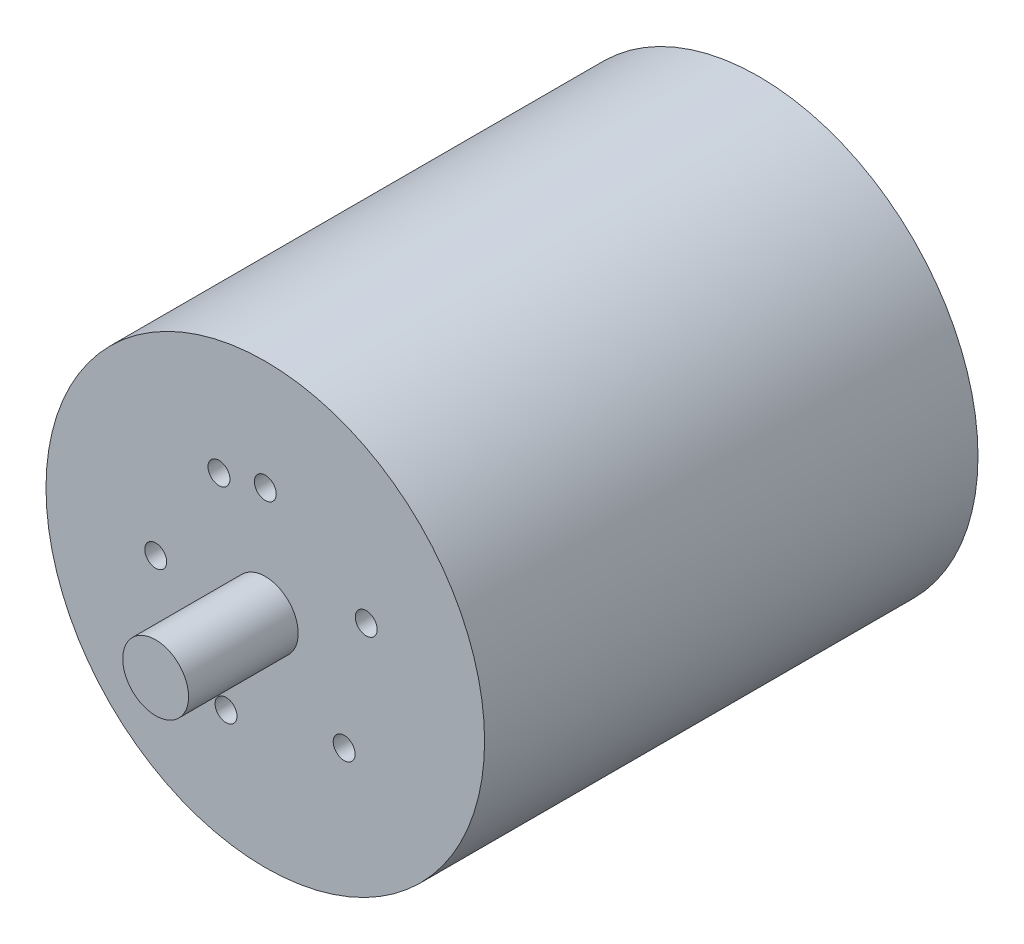
ISO-10303-21;
HEADER;
FILE_DESCRIPTION(('STEP AP214'),'2;1');
FILE_NAME('part.step','',(''),(''),'','','');
FILE_SCHEMA(('AUTOMOTIVE_DESIGN { 1 0 10303 214 1 1 1 1 }'));
ENDSEC;
DATA;
#1=APPLICATION_CONTEXT('core data for automotive mechanical design processes');
#2=APPLICATION_PROTOCOL_DEFINITION('international standard','automotive_design',2000,#1);
#3=PRODUCT_CONTEXT('',#1,'mechanical');
#4=PRODUCT('Part','Part','',(#3));
#5=PRODUCT_RELATED_PRODUCT_CATEGORY('part','',(#4));
#6=PRODUCT_DEFINITION_FORMATION('','',#4);
#7=PRODUCT_DEFINITION_CONTEXT('part definition',#1,'design');
#8=PRODUCT_DEFINITION('design','',#6,#7);
#9=PRODUCT_DEFINITION_SHAPE('','',#8);
#10=(LENGTH_UNIT() NAMED_UNIT(*) SI_UNIT(.MILLI.,.METRE.));
#11=(NAMED_UNIT(*) PLANE_ANGLE_UNIT() SI_UNIT($,.RADIAN.));
#12=(NAMED_UNIT(*) SI_UNIT($,.STERADIAN.) SOLID_ANGLE_UNIT());
#13=UNCERTAINTY_MEASURE_WITH_UNIT(LENGTH_MEASURE(1.E-05),#10,'distance_accuracy_value','');
#14=(GEOMETRIC_REPRESENTATION_CONTEXT(3) GLOBAL_UNCERTAINTY_ASSIGNED_CONTEXT((#13)) GLOBAL_UNIT_ASSIGNED_CONTEXT((#10,
#11,#12)) REPRESENTATION_CONTEXT('',''));
#15=CARTESIAN_POINT('',(0.,0.,0.));
#16=DIRECTION('',(0.,0.,1.));
#17=DIRECTION('',(1.,0.,0.));
#18=AXIS2_PLACEMENT_3D('',#15,#16,#17);
#19=CARTESIAN_POINT('',(0.,0.,22.5));
#20=DIRECTION('',(0.,0.,-1.));
#21=DIRECTION('',(-1.,0.,0.));
#22=AXIS2_PLACEMENT_3D('',#19,#20,#21);
#23=CYLINDRICAL_SURFACE('',#22,20.);
#24=CARTESIAN_POINT('',(0.,0.,22.5));
#25=DIRECTION('',(0.,0.,1.));
#26=DIRECTION('',(1.,0.,0.));
#27=AXIS2_PLACEMENT_3D('',#24,#25,#26);
#28=CIRCLE('',#27,20.);
#29=CARTESIAN_POINT('',(20.,0.,22.5));
#30=VERTEX_POINT('',#29);
#31=EDGE_CURVE('E10',#30,#30,#28,.T.);
#32=ORIENTED_EDGE('',*,*,#31,.F.);
#33=EDGE_LOOP('',(#32));
#34=FACE_BOUND('',#33,.T.);
#35=CARTESIAN_POINT('',(0.,0.,-22.5));
#36=DIRECTION('',(0.,0.,1.));
#37=DIRECTION('',(1.,0.,0.));
#38=AXIS2_PLACEMENT_3D('',#35,#36,#37);
#39=CIRCLE('',#38,20.);
#40=CARTESIAN_POINT('',(20.,0.,-22.5));
#41=VERTEX_POINT('',#40);
#42=EDGE_CURVE('E36',#41,#41,#39,.T.);
#43=ORIENTED_EDGE('',*,*,#42,.T.);
#44=EDGE_LOOP('',(#43));
#45=FACE_BOUND('',#44,.T.);
#46=ADVANCED_FACE('F33',(#34,#45),#23,.T.);
#47=CARTESIAN_POINT('',(0.,0.,22.5));
#48=DIRECTION('',(0.,0.,1.));
#49=DIRECTION('',(1.,0.,0.));
#50=AXIS2_PLACEMENT_3D('',#47,#48,#49);
#51=PLANE('',#50);
#52=CARTESIAN_POINT('',(-4.22618261740691,9.06307787036654,22.5));
#53=DIRECTION('',(0.,0.,1.));
#54=DIRECTION('',(0.906307787036654,0.422618261740691,0.));
#55=AXIS2_PLACEMENT_3D('',#52,#53,#54);
#56=CIRCLE('',#55,1.);
#57=CARTESIAN_POINT('',(-3.31987483037026,9.48569613210723,22.5));
#58=VERTEX_POINT('',#57);
#59=EDGE_CURVE('E81',#58,#58,#56,.T.);
#60=ORIENTED_EDGE('',*,*,#59,.F.);
#61=EDGE_LOOP('',(#60));
#62=FACE_BOUND('',#61,.T.);
#63=CARTESIAN_POINT('',(-9.99390827019096,-0.348994967024937,22.5));
#64=DIRECTION('',(0.,0.,1.));
#65=DIRECTION('',(-0.0348994967024937,0.999390827019096,0.));
#66=AXIS2_PLACEMENT_3D('',#63,#64,#65);
#67=CIRCLE('',#66,1.);
#68=CARTESIAN_POINT('',(-10.0288077668935,0.65039585999416,22.5));
#69=VERTEX_POINT('',#68);
#70=EDGE_CURVE('E75',#69,#69,#67,.T.);
#71=ORIENTED_EDGE('',*,*,#70,.F.);
#72=EDGE_LOOP('',(#71));
#73=FACE_BOUND('',#72,.T.);
#74=CARTESIAN_POINT('',(-3.58367949545305,-9.335804264972,22.5));
#75=DIRECTION('',(0.,0.,1.));
#76=DIRECTION('',(-0.9335804264972,0.358367949545305,0.));
#77=AXIS2_PLACEMENT_3D('',#74,#75,#76);
#78=CIRCLE('',#77,1.);
#79=CARTESIAN_POINT('',(-4.51725992195025,-8.9774363154267,22.5));
#80=VERTEX_POINT('',#79);
#81=EDGE_CURVE('E69',#80,#80,#78,.T.);
#82=ORIENTED_EDGE('',*,*,#81,.F.);
#83=EDGE_LOOP('',(#82));
#84=FACE_BOUND('',#83,.T.);
#85=CARTESIAN_POINT('',(7.19339800338649,-6.94658370459,22.5));
#86=DIRECTION('',(0.,0.,1.));
#87=DIRECTION('',(-0.694658370459,-0.719339800338649,0.));
#88=AXIS2_PLACEMENT_3D('',#85,#86,#87);
#89=CIRCLE('',#88,1.);
#90=CARTESIAN_POINT('',(6.49873963292749,-7.66592350492865,22.5));
#91=VERTEX_POINT('',#90);
#92=EDGE_CURVE('E63',#91,#91,#89,.T.);
#93=ORIENTED_EDGE('',*,*,#92,.F.);
#94=EDGE_LOOP('',(#93));
#95=FACE_BOUND('',#94,.T.);
#96=CARTESIAN_POINT('',(9.20504853452441,3.90731128489272,22.5));
#97=DIRECTION('',(0.,0.,1.));
#98=DIRECTION('',(0.390731128489272,-0.920504853452441,0.));
#99=AXIS2_PLACEMENT_3D('',#96,#97,#98);
#100=CIRCLE('',#99,1.);
#101=CARTESIAN_POINT('',(9.59577966301369,2.98680643144028,22.5));
#102=VERTEX_POINT('',#101);
#103=EDGE_CURVE('E57',#102,#102,#100,.T.);
#104=ORIENTED_EDGE('',*,*,#103,.F.);
#105=EDGE_LOOP('',(#104));
#106=FACE_BOUND('',#105,.T.);
#107=CARTESIAN_POINT('',(0.,10.,22.5));
#108=DIRECTION('',(0.,0.,1.));
#109=DIRECTION('',(1.,0.,0.));
#110=AXIS2_PLACEMENT_3D('',#107,#108,#109);
#111=CIRCLE('',#110,1.);
#112=CARTESIAN_POINT('',(1.,10.,22.5));
#113=VERTEX_POINT('',#112);
#114=EDGE_CURVE('E51',#113,#113,#111,.T.);
#115=ORIENTED_EDGE('',*,*,#114,.F.);
#116=EDGE_LOOP('',(#115));
#117=FACE_BOUND('',#116,.T.);
#118=CARTESIAN_POINT('',(0.,0.,22.5));
#119=DIRECTION('',(0.,0.,1.));
#120=DIRECTION('',(1.,0.,0.));
#121=AXIS2_PLACEMENT_3D('',#118,#119,#120);
#122=CIRCLE('',#121,3.);
#123=CARTESIAN_POINT('',(3.,0.,22.5));
#124=VERTEX_POINT('',#123);
#125=EDGE_CURVE('E45',#124,#124,#122,.T.);
#126=ORIENTED_EDGE('',*,*,#125,.F.);
#127=EDGE_LOOP('',(#126));
#128=FACE_BOUND('',#127,.T.);
#129=ORIENTED_EDGE('',*,*,#31,.T.);
#130=EDGE_LOOP('',(#129));
#131=FACE_BOUND('',#130,.T.);
#132=ADVANCED_FACE('F96',(#62,#73,#84,#95,#106,#117,#128,#131),#51,.T.);
#133=CARTESIAN_POINT('',(0.,0.,-22.5));
#134=DIRECTION('',(0.,0.,1.));
#135=DIRECTION('',(1.,0.,0.));
#136=AXIS2_PLACEMENT_3D('',#133,#134,#135);
#137=PLANE('',#136);
#138=ORIENTED_EDGE('',*,*,#42,.F.);
#139=EDGE_LOOP('',(#138));
#140=FACE_BOUND('',#139,.T.);
#141=ADVANCED_FACE('F99',(#140),#137,.F.);
#142=CARTESIAN_POINT('',(0.,0.,32.5));
#143=DIRECTION('',(0.,0.,-1.));
#144=DIRECTION('',(-1.,0.,0.));
#145=AXIS2_PLACEMENT_3D('',#142,#143,#144);
#146=CYLINDRICAL_SURFACE('',#145,3.);
#147=CARTESIAN_POINT('',(0.,0.,32.5));
#148=DIRECTION('',(0.,0.,1.));
#149=DIRECTION('',(1.,0.,0.));
#150=AXIS2_PLACEMENT_3D('',#147,#148,#149);
#151=CIRCLE('',#150,3.);
#152=CARTESIAN_POINT('',(3.,0.,32.5));
#153=VERTEX_POINT('',#152);
#154=EDGE_CURVE('E43',#153,#153,#151,.T.);
#155=ORIENTED_EDGE('',*,*,#154,.F.);
#156=EDGE_LOOP('',(#155));
#157=FACE_BOUND('',#156,.T.);
#158=ORIENTED_EDGE('',*,*,#125,.T.);
#159=EDGE_LOOP('',(#158));
#160=FACE_BOUND('',#159,.T.);
#161=ADVANCED_FACE('F113',(#157,#160),#146,.T.);
#162=CARTESIAN_POINT('',(0.,0.,32.5));
#163=DIRECTION('',(0.,0.,1.));
#164=DIRECTION('',(1.,0.,0.));
#165=AXIS2_PLACEMENT_3D('',#162,#163,#164);
#166=PLANE('',#165);
#167=ORIENTED_EDGE('',*,*,#154,.T.);
#168=EDGE_LOOP('',(#167));
#169=FACE_BOUND('',#168,.T.);
#170=ADVANCED_FACE('F115',(#169),#166,.T.);
#171=CARTESIAN_POINT('',(0.,10.,20.5));
#172=DIRECTION('',(0.,0.,1.));
#173=DIRECTION('',(1.,0.,0.));
#174=AXIS2_PLACEMENT_3D('',#171,#172,#173);
#175=CYLINDRICAL_SURFACE('',#174,1.);
#176=CARTESIAN_POINT('',(0.,10.,20.5));
#177=DIRECTION('',(0.,0.,1.));
#178=DIRECTION('',(1.,0.,0.));
#179=AXIS2_PLACEMENT_3D('',#176,#177,#178);
#180=CIRCLE('',#179,1.);
#181=CARTESIAN_POINT('',(1.,10.,20.5));
#182=VERTEX_POINT('',#181);
#183=EDGE_CURVE('E48',#182,#182,#180,.T.);
#184=ORIENTED_EDGE('',*,*,#183,.F.);
#185=EDGE_LOOP('',(#184));
#186=FACE_BOUND('',#185,.T.);
#187=ORIENTED_EDGE('',*,*,#114,.T.);
#188=EDGE_LOOP('',(#187));
#189=FACE_BOUND('',#188,.T.);
#190=ADVANCED_FACE('F122',(#186,#189),#175,.F.);
#191=CARTESIAN_POINT('',(0.,10.,20.5));
#192=DIRECTION('',(0.,0.,1.));
#193=DIRECTION('',(1.,0.,0.));
#194=AXIS2_PLACEMENT_3D('',#191,#192,#193);
#195=PLANE('',#194);
#196=ORIENTED_EDGE('',*,*,#183,.T.);
#197=EDGE_LOOP('',(#196));
#198=FACE_BOUND('',#197,.T.);
#199=ADVANCED_FACE('F161',(#198),#195,.T.);
#200=CARTESIAN_POINT('',(9.20504853452441,3.90731128489272,20.5));
#201=DIRECTION('',(0.,0.,1.));
#202=DIRECTION('',(1.,0.,0.));
#203=AXIS2_PLACEMENT_3D('',#200,#201,#202);
#204=CYLINDRICAL_SURFACE('',#203,1.);
#205=CARTESIAN_POINT('',(9.20504853452441,3.90731128489272,20.5));
#206=DIRECTION('',(0.,0.,1.));
#207=DIRECTION('',(0.390731128489272,-0.920504853452441,0.));
#208=AXIS2_PLACEMENT_3D('',#205,#206,#207);
#209=CIRCLE('',#208,1.);
#210=CARTESIAN_POINT('',(9.59577966301369,2.98680643144028,20.5));
#211=VERTEX_POINT('',#210);
#212=EDGE_CURVE('E54',#211,#211,#209,.T.);
#213=ORIENTED_EDGE('',*,*,#212,.F.);
#214=EDGE_LOOP('',(#213));
#215=FACE_BOUND('',#214,.T.);
#216=ORIENTED_EDGE('',*,*,#103,.T.);
#217=EDGE_LOOP('',(#216));
#218=FACE_BOUND('',#217,.T.);
#219=ADVANCED_FACE('F170',(#215,#218),#204,.F.);
#220=CARTESIAN_POINT('',(9.20504853452441,3.90731128489272,20.5));
#221=DIRECTION('',(0.,0.,1.));
#222=DIRECTION('',(0.390731128489272,-0.920504853452441,0.));
#223=AXIS2_PLACEMENT_3D('',#220,#221,#222);
#224=PLANE('',#223);
#225=ORIENTED_EDGE('',*,*,#212,.T.);
#226=EDGE_LOOP('',(#225));
#227=FACE_BOUND('',#226,.T.);
#228=ADVANCED_FACE('F180',(#227),#224,.T.);
#229=CARTESIAN_POINT('',(7.19339800338649,-6.94658370459,20.5));
#230=DIRECTION('',(0.,0.,1.));
#231=DIRECTION('',(1.,0.,0.));
#232=AXIS2_PLACEMENT_3D('',#229,#230,#231);
#233=CYLINDRICAL_SURFACE('',#232,1.);
#234=CARTESIAN_POINT('',(7.19339800338649,-6.94658370459,20.5));
#235=DIRECTION('',(0.,0.,1.));
#236=DIRECTION('',(-0.694658370459,-0.719339800338649,0.));
#237=AXIS2_PLACEMENT_3D('',#234,#235,#236);
#238=CIRCLE('',#237,1.);
#239=CARTESIAN_POINT('',(6.49873963292749,-7.66592350492865,20.5));
#240=VERTEX_POINT('',#239);
#241=EDGE_CURVE('E60',#240,#240,#238,.T.);
#242=ORIENTED_EDGE('',*,*,#241,.F.);
#243=EDGE_LOOP('',(#242));
#244=FACE_BOUND('',#243,.T.);
#245=ORIENTED_EDGE('',*,*,#92,.T.);
#246=EDGE_LOOP('',(#245));
#247=FACE_BOUND('',#246,.T.);
#248=ADVANCED_FACE('F187',(#244,#247),#233,.F.);
#249=CARTESIAN_POINT('',(7.19339800338649,-6.94658370459,20.5));
#250=DIRECTION('',(0.,0.,1.));
#251=DIRECTION('',(-0.694658370459,-0.719339800338649,0.));
#252=AXIS2_PLACEMENT_3D('',#249,#250,#251);
#253=PLANE('',#252);
#254=ORIENTED_EDGE('',*,*,#241,.T.);
#255=EDGE_LOOP('',(#254));
#256=FACE_BOUND('',#255,.T.);
#257=ADVANCED_FACE('F195',(#256),#253,.T.);
#258=CARTESIAN_POINT('',(-3.58367949545305,-9.335804264972,20.5));
#259=DIRECTION('',(0.,0.,1.));
#260=DIRECTION('',(1.,0.,0.));
#261=AXIS2_PLACEMENT_3D('',#258,#259,#260);
#262=CYLINDRICAL_SURFACE('',#261,1.);
#263=CARTESIAN_POINT('',(-3.58367949545305,-9.335804264972,20.5));
#264=DIRECTION('',(0.,0.,1.));
#265=DIRECTION('',(-0.9335804264972,0.358367949545305,0.));
#266=AXIS2_PLACEMENT_3D('',#263,#264,#265);
#267=CIRCLE('',#266,1.);
#268=CARTESIAN_POINT('',(-4.51725992195025,-8.9774363154267,20.5));
#269=VERTEX_POINT('',#268);
#270=EDGE_CURVE('E66',#269,#269,#267,.T.);
#271=ORIENTED_EDGE('',*,*,#270,.F.);
#272=EDGE_LOOP('',(#271));
#273=FACE_BOUND('',#272,.T.);
#274=ORIENTED_EDGE('',*,*,#81,.T.);
#275=EDGE_LOOP('',(#274));
#276=FACE_BOUND('',#275,.T.);
#277=ADVANCED_FACE('F203',(#273,#276),#262,.F.);
#278=CARTESIAN_POINT('',(-3.58367949545305,-9.335804264972,20.5));
#279=DIRECTION('',(0.,0.,1.));
#280=DIRECTION('',(-0.9335804264972,0.358367949545305,0.));
#281=AXIS2_PLACEMENT_3D('',#278,#279,#280);
#282=PLANE('',#281);
#283=ORIENTED_EDGE('',*,*,#270,.T.);
#284=EDGE_LOOP('',(#283));
#285=FACE_BOUND('',#284,.T.);
#286=ADVANCED_FACE('F211',(#285),#282,.T.);
#287=CARTESIAN_POINT('',(-9.99390827019096,-0.348994967024937,20.5));
#288=DIRECTION('',(0.,0.,1.));
#289=DIRECTION('',(1.,0.,0.));
#290=AXIS2_PLACEMENT_3D('',#287,#288,#289);
#291=CYLINDRICAL_SURFACE('',#290,1.);
#292=CARTESIAN_POINT('',(-9.99390827019096,-0.348994967024937,20.5));
#293=DIRECTION('',(0.,0.,1.));
#294=DIRECTION('',(-0.0348994967024937,0.999390827019096,0.));
#295=AXIS2_PLACEMENT_3D('',#292,#293,#294);
#296=CIRCLE('',#295,1.);
#297=CARTESIAN_POINT('',(-10.0288077668935,0.65039585999416,20.5));
#298=VERTEX_POINT('',#297);
#299=EDGE_CURVE('E72',#298,#298,#296,.T.);
#300=ORIENTED_EDGE('',*,*,#299,.F.);
#301=EDGE_LOOP('',(#300));
#302=FACE_BOUND('',#301,.T.);
#303=ORIENTED_EDGE('',*,*,#70,.T.);
#304=EDGE_LOOP('',(#303));
#305=FACE_BOUND('',#304,.T.);
#306=ADVANCED_FACE('F219',(#302,#305),#291,.F.);
#307=CARTESIAN_POINT('',(-9.99390827019096,-0.348994967024937,20.5));
#308=DIRECTION('',(0.,0.,1.));
#309=DIRECTION('',(-0.0348994967024937,0.999390827019096,0.));
#310=AXIS2_PLACEMENT_3D('',#307,#308,#309);
#311=PLANE('',#310);
#312=ORIENTED_EDGE('',*,*,#299,.T.);
#313=EDGE_LOOP('',(#312));
#314=FACE_BOUND('',#313,.T.);
#315=ADVANCED_FACE('F92',(#314),#311,.T.);
#316=CARTESIAN_POINT('',(-4.22618261740691,9.06307787036654,20.5));
#317=DIRECTION('',(0.,0.,1.));
#318=DIRECTION('',(1.,0.,0.));
#319=AXIS2_PLACEMENT_3D('',#316,#317,#318);
#320=CYLINDRICAL_SURFACE('',#319,1.);
#321=CARTESIAN_POINT('',(-4.22618261740691,9.06307787036654,20.5));
#322=DIRECTION('',(0.,0.,1.));
#323=DIRECTION('',(0.906307787036654,0.422618261740691,0.));
#324=AXIS2_PLACEMENT_3D('',#321,#322,#323);
#325=CIRCLE('',#324,1.);
#326=CARTESIAN_POINT('',(-3.31987483037026,9.48569613210723,20.5));
#327=VERTEX_POINT('',#326);
#328=EDGE_CURVE('E78',#327,#327,#325,.T.);
#329=ORIENTED_EDGE('',*,*,#328,.F.);
#330=EDGE_LOOP('',(#329));
#331=FACE_BOUND('',#330,.T.);
#332=ORIENTED_EDGE('',*,*,#59,.T.);
#333=EDGE_LOOP('',(#332));
#334=FACE_BOUND('',#333,.T.);
#335=ADVANCED_FACE('F89',(#331,#334),#320,.F.);
#336=CARTESIAN_POINT('',(-4.22618261740691,9.06307787036654,20.5));
#337=DIRECTION('',(0.,0.,1.));
#338=DIRECTION('',(0.906307787036654,0.422618261740691,0.));
#339=AXIS2_PLACEMENT_3D('',#336,#337,#338);
#340=PLANE('',#339);
#341=ORIENTED_EDGE('',*,*,#328,.T.);
#342=EDGE_LOOP('',(#341));
#343=FACE_BOUND('',#342,.T.);
#344=ADVANCED_FACE('F87',(#343),#340,.T.);
#345=CLOSED_SHELL('',(#46,#132,#141,#161,#170,#190,#199,#219,#228,#248,#257,#277,#286,#306,#315,
#335,#344));
#346=MANIFOLD_SOLID_BREP('B2',#345);
#347=ADVANCED_BREP_SHAPE_REPRESENTATION('',(#18,#346),#14);
#348=SHAPE_DEFINITION_REPRESENTATION(#9,#347);
ENDSEC;
END-ISO-10303-21;
